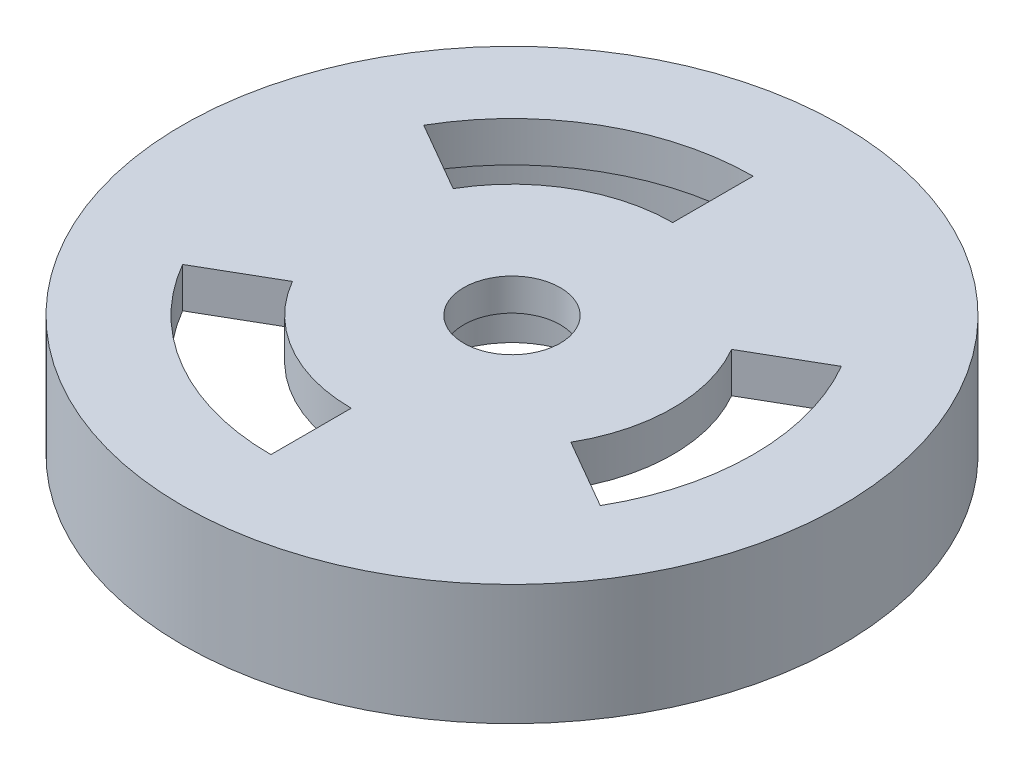
ISO-10303-21;
HEADER;
FILE_DESCRIPTION(('STEP AP214'),'2;1');
FILE_NAME('part.step','',(''),(''),'','','');
FILE_SCHEMA(('AUTOMOTIVE_DESIGN { 1 0 10303 214 1 1 1 1 }'));
ENDSEC;
DATA;
#1=APPLICATION_CONTEXT('core data for automotive mechanical design processes');
#2=APPLICATION_PROTOCOL_DEFINITION('international standard','automotive_design',2000,#1);
#3=PRODUCT_CONTEXT('',#1,'mechanical');
#4=PRODUCT('Part','Part','',(#3));
#5=PRODUCT_RELATED_PRODUCT_CATEGORY('part','',(#4));
#6=PRODUCT_DEFINITION_FORMATION('','',#4);
#7=PRODUCT_DEFINITION_CONTEXT('part definition',#1,'design');
#8=PRODUCT_DEFINITION('design','',#6,#7);
#9=PRODUCT_DEFINITION_SHAPE('','',#8);
#10=(LENGTH_UNIT() NAMED_UNIT(*) SI_UNIT(.MILLI.,.METRE.));
#11=(NAMED_UNIT(*) PLANE_ANGLE_UNIT() SI_UNIT($,.RADIAN.));
#12=(NAMED_UNIT(*) SI_UNIT($,.STERADIAN.) SOLID_ANGLE_UNIT());
#13=UNCERTAINTY_MEASURE_WITH_UNIT(LENGTH_MEASURE(1.E-05),#10,'distance_accuracy_value','');
#14=(GEOMETRIC_REPRESENTATION_CONTEXT(3) GLOBAL_UNCERTAINTY_ASSIGNED_CONTEXT((#13)) GLOBAL_UNIT_ASSIGNED_CONTEXT((#10,
#11,#12)) REPRESENTATION_CONTEXT('',''));
#15=CARTESIAN_POINT('',(0.,0.,0.));
#16=DIRECTION('',(0.,0.,1.));
#17=DIRECTION('',(1.,0.,0.));
#18=AXIS2_PLACEMENT_3D('',#15,#16,#17);
#19=CARTESIAN_POINT('',(0.,10.,0.));
#20=DIRECTION('',(0.,1.,0.));
#21=DIRECTION('',(0.,0.,1.));
#22=AXIS2_PLACEMENT_3D('',#19,#20,#21);
#23=PLANE('',#22);
#24=DIRECTION('',(0.,0.,1.));
#25=VECTOR('',#24,1.);
#26=CARTESIAN_POINT('',(-4.11129463806503E-13,10.,-30.));
#27=LINE('',#26,#25);
#28=CARTESIAN_POINT('',(-4.11129463806503E-13,10.,-30.));
#29=VERTEX_POINT('',#28);
#30=CARTESIAN_POINT('',(-2.66453525910038E-13,10.,-20.));
#31=VERTEX_POINT('',#30);
#32=EDGE_CURVE('E150',#29,#31,#27,.T.);
#33=ORIENTED_EDGE('',*,*,#32,.F.);
#34=CARTESIAN_POINT('',(0.,10.,0.));
#35=DIRECTION('',(0.,-1.,0.));
#36=DIRECTION('',(0.,0.,-1.));
#37=AXIS2_PLACEMENT_3D('',#34,#35,#36);
#38=CIRCLE('',#37,30.);
#39=CARTESIAN_POINT('',(-25.9807621135333,10.,-14.9999999999998));
#40=VERTEX_POINT('',#39);
#41=EDGE_CURVE('E49',#40,#29,#38,.T.);
#42=ORIENTED_EDGE('',*,*,#41,.F.);
#43=DIRECTION('',(-0.866025403784443,0.,-0.499999999999992));
#44=VECTOR('',#43,1.);
#45=CARTESIAN_POINT('',(-17.3205080756889,10.,-9.99999999999984));
#46=LINE('',#45,#44);
#47=CARTESIAN_POINT('',(-17.3205080756889,10.,-9.99999999999984));
#48=VERTEX_POINT('',#47);
#49=EDGE_CURVE('E141',#48,#40,#46,.T.);
#50=ORIENTED_EDGE('',*,*,#49,.F.);
#51=CARTESIAN_POINT('',(0.,10.,0.));
#52=DIRECTION('',(0.,1.,0.));
#53=DIRECTION('',(0.,0.,-1.));
#54=AXIS2_PLACEMENT_3D('',#51,#52,#53);
#55=CIRCLE('',#54,20.);
#56=EDGE_CURVE('E144',#31,#48,#55,.T.);
#57=ORIENTED_EDGE('',*,*,#56,.F.);
#58=EDGE_LOOP('',(#33,#42,#50,#57));
#59=FACE_BOUND('',#58,.T.);
#60=DIRECTION('',(-0.866025403784443,0.,-0.499999999999992));
#61=VECTOR('',#60,1.);
#62=CARTESIAN_POINT('',(25.9807621135333,10.,14.9999999999998));
#63=LINE('',#62,#61);
#64=CARTESIAN_POINT('',(25.9807621135333,10.,14.9999999999998));
#65=VERTEX_POINT('',#64);
#66=CARTESIAN_POINT('',(17.3205080756889,10.,9.99999999999984));
#67=VERTEX_POINT('',#66);
#68=EDGE_CURVE('E175',#65,#67,#63,.T.);
#69=ORIENTED_EDGE('',*,*,#68,.F.);
#70=CARTESIAN_POINT('',(0.,10.,0.));
#71=DIRECTION('',(0.,-1.,0.));
#72=DIRECTION('',(0.,0.,-1.));
#73=AXIS2_PLACEMENT_3D('',#70,#71,#72);
#74=CIRCLE('',#73,30.);
#75=CARTESIAN_POINT('',(25.9807621135331,10.,-15.0000000000001));
#76=VERTEX_POINT('',#75);
#77=EDGE_CURVE('E156',#76,#65,#74,.T.);
#78=ORIENTED_EDGE('',*,*,#77,.F.);
#79=DIRECTION('',(0.866025403784436,0.,-0.500000000000004));
#80=VECTOR('',#79,1.);
#81=CARTESIAN_POINT('',(17.3205080756887,10.,-10.0000000000001));
#82=LINE('',#81,#80);
#83=CARTESIAN_POINT('',(17.3205080756887,10.,-10.0000000000001));
#84=VERTEX_POINT('',#83);
#85=EDGE_CURVE('E164',#84,#76,#82,.T.);
#86=ORIENTED_EDGE('',*,*,#85,.F.);
#87=CARTESIAN_POINT('',(0.,10.,0.));
#88=DIRECTION('',(0.,1.,0.));
#89=DIRECTION('',(0.,0.,-1.));
#90=AXIS2_PLACEMENT_3D('',#87,#88,#89);
#91=CIRCLE('',#90,20.);
#92=EDGE_CURVE('E178',#67,#84,#91,.T.);
#93=ORIENTED_EDGE('',*,*,#92,.F.);
#94=EDGE_LOOP('',(#69,#78,#86,#93));
#95=FACE_BOUND('',#94,.T.);
#96=DIRECTION('',(0.866025403784436,0.,-0.500000000000004));
#97=VECTOR('',#96,1.);
#98=CARTESIAN_POINT('',(-25.9807621135331,10.,15.0000000000001));
#99=LINE('',#98,#97);
#100=CARTESIAN_POINT('',(-25.9807621135331,10.,15.0000000000001));
#101=VERTEX_POINT('',#100);
#102=CARTESIAN_POINT('',(-17.3205080756887,10.,10.0000000000001));
#103=VERTEX_POINT('',#102);
#104=EDGE_CURVE('E207',#101,#103,#99,.T.);
#105=ORIENTED_EDGE('',*,*,#104,.F.);
#106=CARTESIAN_POINT('',(0.,10.,0.));
#107=DIRECTION('',(0.,-1.,0.));
#108=DIRECTION('',(0.,0.,-1.));
#109=AXIS2_PLACEMENT_3D('',#106,#107,#108);
#110=CIRCLE('',#109,30.);
#111=CARTESIAN_POINT('',(0.,10.,30.));
#112=VERTEX_POINT('',#111);
#113=EDGE_CURVE('E185',#112,#101,#110,.T.);
#114=ORIENTED_EDGE('',*,*,#113,.F.);
#115=DIRECTION('',(0.,0.,1.));
#116=VECTOR('',#115,1.);
#117=CARTESIAN_POINT('',(0.,10.,20.));
#118=LINE('',#117,#116);
#119=CARTESIAN_POINT('',(0.,10.,20.));
#120=VERTEX_POINT('',#119);
#121=EDGE_CURVE('E196',#120,#112,#118,.T.);
#122=ORIENTED_EDGE('',*,*,#121,.F.);
#123=CARTESIAN_POINT('',(0.,10.,0.));
#124=DIRECTION('',(0.,1.,0.));
#125=DIRECTION('',(0.,0.,-1.));
#126=AXIS2_PLACEMENT_3D('',#123,#124,#125);
#127=CIRCLE('',#126,20.);
#128=EDGE_CURVE('E210',#103,#120,#127,.T.);
#129=ORIENTED_EDGE('',*,*,#128,.F.);
#130=EDGE_LOOP('',(#105,#114,#122,#129));
#131=FACE_BOUND('',#130,.T.);
#132=CARTESIAN_POINT('',(0.,10.,0.));
#133=DIRECTION('',(0.,1.,0.));
#134=DIRECTION('',(0.,0.,1.));
#135=AXIS2_PLACEMENT_3D('',#132,#133,#134);
#136=CIRCLE('',#135,38.);
#137=CARTESIAN_POINT('',(0.,10.,38.));
#138=VERTEX_POINT('',#137);
#139=EDGE_CURVE('E241',#138,#138,#136,.T.);
#140=ORIENTED_EDGE('',*,*,#139,.F.);
#141=EDGE_LOOP('',(#140));
#142=FACE_BOUND('',#141,.T.);
#143=CARTESIAN_POINT('',(0.,10.,0.));
#144=DIRECTION('',(0.,1.,0.));
#145=DIRECTION('',(0.,0.,1.));
#146=AXIS2_PLACEMENT_3D('',#143,#144,#145);
#147=CIRCLE('',#146,12.5);
#148=CARTESIAN_POINT('',(0.,10.,12.5));
#149=VERTEX_POINT('',#148);
#150=EDGE_CURVE('E11',#149,#149,#147,.F.);
#151=ORIENTED_EDGE('',*,*,#150,.F.);
#152=EDGE_LOOP('',(#151));
#153=FACE_BOUND('',#152,.T.);
#154=ADVANCED_FACE('F34',(#59,#95,#131,#142,#153),#23,.F.);
#155=CARTESIAN_POINT('',(0.,0.,0.));
#156=DIRECTION('',(0.,1.,0.));
#157=DIRECTION('',(0.,0.,1.));
#158=AXIS2_PLACEMENT_3D('',#155,#156,#157);
#159=PLANE('',#158);
#160=CARTESIAN_POINT('',(0.,0.,0.));
#161=DIRECTION('',(0.,1.,0.));
#162=DIRECTION('',(0.,0.,1.));
#163=AXIS2_PLACEMENT_3D('',#160,#161,#162);
#164=CIRCLE('',#163,41.);
#165=CARTESIAN_POINT('',(0.,0.,41.));
#166=VERTEX_POINT('',#165);
#167=EDGE_CURVE('E42',#166,#166,#164,.T.);
#168=ORIENTED_EDGE('',*,*,#167,.F.);
#169=EDGE_LOOP('',(#168));
#170=FACE_BOUND('',#169,.T.);
#171=CARTESIAN_POINT('',(0.,0.,0.));
#172=DIRECTION('',(0.,1.,0.));
#173=DIRECTION('',(0.,0.,1.));
#174=AXIS2_PLACEMENT_3D('',#171,#172,#173);
#175=CIRCLE('',#174,38.);
#176=CARTESIAN_POINT('',(0.,0.,38.));
#177=VERTEX_POINT('',#176);
#178=EDGE_CURVE('E244',#177,#177,#175,.T.);
#179=ORIENTED_EDGE('',*,*,#178,.T.);
#180=EDGE_LOOP('',(#179));
#181=FACE_BOUND('',#180,.T.);
#182=ADVANCED_FACE('F251',(#170,#181),#159,.F.);
#183=CARTESIAN_POINT('',(0.,10.,0.));
#184=DIRECTION('',(0.,-1.,0.));
#185=DIRECTION('',(0.,0.,-1.));
#186=AXIS2_PLACEMENT_3D('',#183,#184,#185);
#187=CYLINDRICAL_SURFACE('',#186,41.);
#188=ORIENTED_EDGE('',*,*,#167,.T.);
#189=EDGE_LOOP('',(#188));
#190=FACE_BOUND('',#189,.T.);
#191=CARTESIAN_POINT('',(0.,15.,0.));
#192=DIRECTION('',(0.,1.,0.));
#193=DIRECTION('',(0.,0.,1.));
#194=AXIS2_PLACEMENT_3D('',#191,#192,#193);
#195=CIRCLE('',#194,41.);
#196=CARTESIAN_POINT('',(0.,15.,41.));
#197=VERTEX_POINT('',#196);
#198=EDGE_CURVE('E238',#197,#197,#195,.T.);
#199=ORIENTED_EDGE('',*,*,#198,.F.);
#200=EDGE_LOOP('',(#199));
#201=FACE_BOUND('',#200,.T.);
#202=ADVANCED_FACE('F36',(#190,#201),#187,.T.);
#203=CARTESIAN_POINT('',(0.,10.,0.));
#204=DIRECTION('',(0.,-1.,0.));
#205=DIRECTION('',(0.,0.,-1.));
#206=AXIS2_PLACEMENT_3D('',#203,#204,#205);
#207=CYLINDRICAL_SURFACE('',#206,38.);
#208=ORIENTED_EDGE('',*,*,#139,.T.);
#209=EDGE_LOOP('',(#208));
#210=FACE_BOUND('',#209,.T.);
#211=ORIENTED_EDGE('',*,*,#178,.F.);
#212=EDGE_LOOP('',(#211));
#213=FACE_BOUND('',#212,.T.);
#214=ADVANCED_FACE('F256',(#210,#213),#207,.F.);
#215=CARTESIAN_POINT('',(0.,15.,0.));
#216=DIRECTION('',(0.,1.,0.));
#217=DIRECTION('',(0.,0.,1.));
#218=AXIS2_PLACEMENT_3D('',#215,#216,#217);
#219=PLANE('',#218);
#220=CARTESIAN_POINT('',(0.,15.,0.));
#221=DIRECTION('',(0.,-1.,0.));
#222=DIRECTION('',(0.,0.,-1.));
#223=AXIS2_PLACEMENT_3D('',#220,#221,#222);
#224=CIRCLE('',#223,30.);
#225=CARTESIAN_POINT('',(-25.9807621135333,15.,-14.9999999999998));
#226=VERTEX_POINT('',#225);
#227=CARTESIAN_POINT('',(-4.11129463806503E-13,15.,-30.));
#228=VERTEX_POINT('',#227);
#229=EDGE_CURVE('E125',#226,#228,#224,.T.);
#230=ORIENTED_EDGE('',*,*,#229,.T.);
#231=DIRECTION('',(0.,0.,1.));
#232=VECTOR('',#231,1.);
#233=CARTESIAN_POINT('',(-4.11129463806503E-13,15.,-30.));
#234=LINE('',#233,#232);
#235=CARTESIAN_POINT('',(-2.67147415300428E-13,15.,-20.));
#236=VERTEX_POINT('',#235);
#237=EDGE_CURVE('E134',#228,#236,#234,.T.);
#238=ORIENTED_EDGE('',*,*,#237,.T.);
#239=CARTESIAN_POINT('',(0.,15.,0.));
#240=DIRECTION('',(0.,1.,0.));
#241=DIRECTION('',(0.,0.,-1.));
#242=AXIS2_PLACEMENT_3D('',#239,#240,#241);
#243=CIRCLE('',#242,20.);
#244=CARTESIAN_POINT('',(-17.3205080756889,15.,-9.99999999999984));
#245=VERTEX_POINT('',#244);
#246=EDGE_CURVE('E57',#236,#245,#243,.T.);
#247=ORIENTED_EDGE('',*,*,#246,.T.);
#248=DIRECTION('',(-0.866025403784443,0.,-0.499999999999992));
#249=VECTOR('',#248,1.);
#250=CARTESIAN_POINT('',(-17.3205080756889,15.,-9.99999999999984));
#251=LINE('',#250,#249);
#252=EDGE_CURVE('E131',#245,#226,#251,.T.);
#253=ORIENTED_EDGE('',*,*,#252,.T.);
#254=EDGE_LOOP('',(#230,#238,#247,#253));
#255=FACE_BOUND('',#254,.T.);
#256=CARTESIAN_POINT('',(0.,15.,0.));
#257=DIRECTION('',(0.,-1.,0.));
#258=DIRECTION('',(0.,0.,-1.));
#259=AXIS2_PLACEMENT_3D('',#256,#257,#258);
#260=CIRCLE('',#259,30.);
#261=CARTESIAN_POINT('',(25.9807621135331,15.,-15.0000000000001));
#262=VERTEX_POINT('',#261);
#263=CARTESIAN_POINT('',(25.9807621135333,15.,14.9999999999998));
#264=VERTEX_POINT('',#263);
#265=EDGE_CURVE('E160',#262,#264,#260,.T.);
#266=ORIENTED_EDGE('',*,*,#265,.T.);
#267=DIRECTION('',(-0.866025403784443,0.,-0.499999999999992));
#268=VECTOR('',#267,1.);
#269=CARTESIAN_POINT('',(25.9807621135333,15.,14.9999999999998));
#270=LINE('',#269,#268);
#271=CARTESIAN_POINT('',(17.3205080756889,15.,9.99999999999984));
#272=VERTEX_POINT('',#271);
#273=EDGE_CURVE('E163',#264,#272,#270,.T.);
#274=ORIENTED_EDGE('',*,*,#273,.T.);
#275=CARTESIAN_POINT('',(0.,15.,0.));
#276=DIRECTION('',(0.,1.,0.));
#277=DIRECTION('',(0.,0.,-1.));
#278=AXIS2_PLACEMENT_3D('',#275,#276,#277);
#279=CIRCLE('',#278,20.);
#280=CARTESIAN_POINT('',(17.3205080756887,15.,-10.0000000000001));
#281=VERTEX_POINT('',#280);
#282=EDGE_CURVE('E167',#272,#281,#279,.T.);
#283=ORIENTED_EDGE('',*,*,#282,.T.);
#284=DIRECTION('',(0.866025403784436,0.,-0.500000000000004));
#285=VECTOR('',#284,1.);
#286=CARTESIAN_POINT('',(17.3205080756887,15.,-10.0000000000001));
#287=LINE('',#286,#285);
#288=EDGE_CURVE('E170',#281,#262,#287,.T.);
#289=ORIENTED_EDGE('',*,*,#288,.T.);
#290=EDGE_LOOP('',(#266,#274,#283,#289));
#291=FACE_BOUND('',#290,.T.);
#292=CARTESIAN_POINT('',(0.,15.,0.));
#293=DIRECTION('',(0.,-1.,0.));
#294=DIRECTION('',(0.,0.,-1.));
#295=AXIS2_PLACEMENT_3D('',#292,#293,#294);
#296=CIRCLE('',#295,30.);
#297=CARTESIAN_POINT('',(0.,15.,30.));
#298=VERTEX_POINT('',#297);
#299=CARTESIAN_POINT('',(-25.9807621135331,15.,15.0000000000001));
#300=VERTEX_POINT('',#299);
#301=EDGE_CURVE('E192',#298,#300,#296,.T.);
#302=ORIENTED_EDGE('',*,*,#301,.T.);
#303=DIRECTION('',(0.866025403784436,0.,-0.500000000000004));
#304=VECTOR('',#303,1.);
#305=CARTESIAN_POINT('',(-25.9807621135331,15.,15.0000000000001));
#306=LINE('',#305,#304);
#307=CARTESIAN_POINT('',(-17.3205080756887,15.,10.0000000000001));
#308=VERTEX_POINT('',#307);
#309=EDGE_CURVE('E195',#300,#308,#306,.T.);
#310=ORIENTED_EDGE('',*,*,#309,.T.);
#311=CARTESIAN_POINT('',(0.,15.,0.));
#312=DIRECTION('',(0.,1.,0.));
#313=DIRECTION('',(0.,0.,-1.));
#314=AXIS2_PLACEMENT_3D('',#311,#312,#313);
#315=CIRCLE('',#314,20.);
#316=CARTESIAN_POINT('',(0.,15.,20.));
#317=VERTEX_POINT('',#316);
#318=EDGE_CURVE('E199',#308,#317,#315,.T.);
#319=ORIENTED_EDGE('',*,*,#318,.T.);
#320=DIRECTION('',(0.,0.,1.));
#321=VECTOR('',#320,1.);
#322=CARTESIAN_POINT('',(0.,15.,20.));
#323=LINE('',#322,#321);
#324=EDGE_CURVE('E202',#317,#298,#323,.T.);
#325=ORIENTED_EDGE('',*,*,#324,.T.);
#326=EDGE_LOOP('',(#302,#310,#319,#325));
#327=FACE_BOUND('',#326,.T.);
#328=CARTESIAN_POINT('',(0.,15.,0.));
#329=DIRECTION('',(0.,-1.,0.));
#330=DIRECTION('',(0.,0.,-1.));
#331=AXIS2_PLACEMENT_3D('',#328,#329,#330);
#332=CIRCLE('',#331,6.);
#333=CARTESIAN_POINT('',(0.,15.,-6.));
#334=VERTEX_POINT('',#333);
#335=EDGE_CURVE('E224',#334,#334,#332,.T.);
#336=ORIENTED_EDGE('',*,*,#335,.T.);
#337=EDGE_LOOP('',(#336));
#338=FACE_BOUND('',#337,.T.);
#339=ORIENTED_EDGE('',*,*,#198,.T.);
#340=EDGE_LOOP('',(#339));
#341=FACE_BOUND('',#340,.T.);
#342=ADVANCED_FACE('F138',(#255,#291,#327,#338,#341),#219,.T.);
#343=CARTESIAN_POINT('',(0.,5.,0.));
#344=DIRECTION('',(0.,1.,0.));
#345=DIRECTION('',(0.,0.,1.));
#346=AXIS2_PLACEMENT_3D('',#343,#344,#345);
#347=CYLINDRICAL_SURFACE('',#346,12.5);
#348=CARTESIAN_POINT('',(0.,5.,0.));
#349=DIRECTION('',(0.,-1.,0.));
#350=DIRECTION('',(0.,0.,-1.));
#351=AXIS2_PLACEMENT_3D('',#348,#349,#350);
#352=CIRCLE('',#351,12.5);
#353=CARTESIAN_POINT('',(0.,5.,-12.5));
#354=VERTEX_POINT('',#353);
#355=EDGE_CURVE('E233',#354,#354,#352,.T.);
#356=ORIENTED_EDGE('',*,*,#355,.F.);
#357=EDGE_LOOP('',(#356));
#358=FACE_BOUND('',#357,.T.);
#359=ORIENTED_EDGE('',*,*,#150,.T.);
#360=EDGE_LOOP('',(#359));
#361=FACE_BOUND('',#360,.T.);
#362=ADVANCED_FACE('F264',(#358,#361),#347,.T.);
#363=CARTESIAN_POINT('',(0.,5.,0.));
#364=DIRECTION('',(0.,-1.,0.));
#365=DIRECTION('',(0.,0.,-1.));
#366=AXIS2_PLACEMENT_3D('',#363,#364,#365);
#367=PLANE('',#366);
#368=CARTESIAN_POINT('',(0.,5.,0.));
#369=DIRECTION('',(0.,-1.,0.));
#370=DIRECTION('',(0.,0.,-1.));
#371=AXIS2_PLACEMENT_3D('',#368,#369,#370);
#372=CIRCLE('',#371,10.);
#373=CARTESIAN_POINT('',(0.,5.,-10.));
#374=VERTEX_POINT('',#373);
#375=EDGE_CURVE('E227',#374,#374,#372,.T.);
#376=ORIENTED_EDGE('',*,*,#375,.F.);
#377=EDGE_LOOP('',(#376));
#378=FACE_BOUND('',#377,.T.);
#379=ORIENTED_EDGE('',*,*,#355,.T.);
#380=EDGE_LOOP('',(#379));
#381=FACE_BOUND('',#380,.T.);
#382=ADVANCED_FACE('F275',(#378,#381),#367,.T.);
#383=CARTESIAN_POINT('',(0.,11.,0.));
#384=DIRECTION('',(0.,-1.,0.));
#385=DIRECTION('',(0.,0.,-1.));
#386=AXIS2_PLACEMENT_3D('',#383,#384,#385);
#387=CYLINDRICAL_SURFACE('',#386,10.);
#388=CARTESIAN_POINT('',(0.,11.,0.));
#389=DIRECTION('',(0.,-1.,0.));
#390=DIRECTION('',(0.,0.,-1.));
#391=AXIS2_PLACEMENT_3D('',#388,#389,#390);
#392=CIRCLE('',#391,10.);
#393=CARTESIAN_POINT('',(0.,11.,-10.));
#394=VERTEX_POINT('',#393);
#395=EDGE_CURVE('E230',#394,#394,#392,.T.);
#396=ORIENTED_EDGE('',*,*,#395,.F.);
#397=EDGE_LOOP('',(#396));
#398=FACE_BOUND('',#397,.T.);
#399=ORIENTED_EDGE('',*,*,#375,.T.);
#400=EDGE_LOOP('',(#399));
#401=FACE_BOUND('',#400,.T.);
#402=ADVANCED_FACE('F279',(#398,#401),#387,.F.);
#403=CARTESIAN_POINT('',(0.,11.,0.));
#404=DIRECTION('',(0.,-1.,0.));
#405=DIRECTION('',(0.,0.,-1.));
#406=AXIS2_PLACEMENT_3D('',#403,#404,#405);
#407=PLANE('',#406);
#408=CARTESIAN_POINT('',(0.,11.,0.));
#409=DIRECTION('',(0.,-1.,0.));
#410=DIRECTION('',(0.,0.,-1.));
#411=AXIS2_PLACEMENT_3D('',#408,#409,#410);
#412=CIRCLE('',#411,6.);
#413=CARTESIAN_POINT('',(0.,11.,-6.));
#414=VERTEX_POINT('',#413);
#415=EDGE_CURVE('E217',#414,#414,#412,.T.);
#416=ORIENTED_EDGE('',*,*,#415,.F.);
#417=EDGE_LOOP('',(#416));
#418=FACE_BOUND('',#417,.T.);
#419=ORIENTED_EDGE('',*,*,#395,.T.);
#420=EDGE_LOOP('',(#419));
#421=FACE_BOUND('',#420,.T.);
#422=ADVANCED_FACE('F283',(#418,#421),#407,.T.);
#423=CARTESIAN_POINT('',(0.,15.,0.));
#424=DIRECTION('',(0.,-1.,0.));
#425=DIRECTION('',(0.,0.,-1.));
#426=AXIS2_PLACEMENT_3D('',#423,#424,#425);
#427=CYLINDRICAL_SURFACE('',#426,6.);
#428=ORIENTED_EDGE('',*,*,#335,.F.);
#429=EDGE_LOOP('',(#428));
#430=FACE_BOUND('',#429,.T.);
#431=ORIENTED_EDGE('',*,*,#415,.T.);
#432=EDGE_LOOP('',(#431));
#433=FACE_BOUND('',#432,.T.);
#434=ADVANCED_FACE('F287',(#430,#433),#427,.F.);
#435=CARTESIAN_POINT('',(0.,15.,0.));
#436=DIRECTION('',(0.,-1.,0.));
#437=DIRECTION('',(0.,0.,-1.));
#438=AXIS2_PLACEMENT_3D('',#435,#436,#437);
#439=CYLINDRICAL_SURFACE('',#438,30.);
#440=ORIENTED_EDGE('',*,*,#113,.T.);
#441=DIRECTION('',(0.,-1.,0.));
#442=VECTOR('',#441,1.);
#443=CARTESIAN_POINT('',(-25.9807621135331,15.,15.0000000000001));
#444=LINE('',#443,#442);
#445=EDGE_CURVE('E205',#300,#101,#444,.T.);
#446=ORIENTED_EDGE('',*,*,#445,.F.);
#447=ORIENTED_EDGE('',*,*,#301,.F.);
#448=DIRECTION('',(0.,-1.,0.));
#449=VECTOR('',#448,1.);
#450=CARTESIAN_POINT('',(0.,15.,30.));
#451=LINE('',#450,#449);
#452=EDGE_CURVE('E215',#298,#112,#451,.T.);
#453=ORIENTED_EDGE('',*,*,#452,.T.);
#454=EDGE_LOOP('',(#440,#446,#447,#453));
#455=FACE_BOUND('',#454,.T.);
#456=ADVANCED_FACE('F291',(#455),#439,.F.);
#457=CARTESIAN_POINT('',(0.,15.,20.));
#458=DIRECTION('',(1.,0.,0.));
#459=DIRECTION('',(0.,0.,-1.));
#460=AXIS2_PLACEMENT_3D('',#457,#458,#459);
#461=PLANE('',#460);
#462=ORIENTED_EDGE('',*,*,#121,.T.);
#463=ORIENTED_EDGE('',*,*,#452,.F.);
#464=ORIENTED_EDGE('',*,*,#324,.F.);
#465=DIRECTION('',(0.,-1.,0.));
#466=VECTOR('',#465,1.);
#467=CARTESIAN_POINT('',(0.,15.,20.));
#468=LINE('',#467,#466);
#469=EDGE_CURVE('E218',#317,#120,#468,.T.);
#470=ORIENTED_EDGE('',*,*,#469,.T.);
#471=EDGE_LOOP('',(#462,#463,#464,#470));
#472=FACE_BOUND('',#471,.T.);
#473=ADVANCED_FACE('F295',(#472),#461,.F.);
#474=CARTESIAN_POINT('',(0.,15.,0.));
#475=DIRECTION('',(0.,-1.,0.));
#476=DIRECTION('',(0.,0.,-1.));
#477=AXIS2_PLACEMENT_3D('',#474,#475,#476);
#478=CYLINDRICAL_SURFACE('',#477,20.);
#479=ORIENTED_EDGE('',*,*,#128,.T.);
#480=ORIENTED_EDGE('',*,*,#469,.F.);
#481=ORIENTED_EDGE('',*,*,#318,.F.);
#482=DIRECTION('',(0.,-1.,0.));
#483=VECTOR('',#482,1.);
#484=CARTESIAN_POINT('',(-17.3205080756887,15.,10.0000000000001));
#485=LINE('',#484,#483);
#486=EDGE_CURVE('E220',#308,#103,#485,.T.);
#487=ORIENTED_EDGE('',*,*,#486,.T.);
#488=EDGE_LOOP('',(#479,#480,#481,#487));
#489=FACE_BOUND('',#488,.T.);
#490=ADVANCED_FACE('F301',(#489),#478,.T.);
#491=CARTESIAN_POINT('',(-25.9807621135331,15.,15.0000000000001));
#492=DIRECTION('',(-0.500000000000004,0.,-0.866025403784436));
#493=DIRECTION('',(-0.866025403784436,0.,0.500000000000004));
#494=AXIS2_PLACEMENT_3D('',#491,#492,#493);
#495=PLANE('',#494);
#496=ORIENTED_EDGE('',*,*,#104,.T.);
#497=ORIENTED_EDGE('',*,*,#486,.F.);
#498=ORIENTED_EDGE('',*,*,#309,.F.);
#499=ORIENTED_EDGE('',*,*,#445,.T.);
#500=EDGE_LOOP('',(#496,#497,#498,#499));
#501=FACE_BOUND('',#500,.T.);
#502=ADVANCED_FACE('F297',(#501),#495,.F.);
#503=CARTESIAN_POINT('',(0.,15.,0.));
#504=DIRECTION('',(0.,-1.,0.));
#505=DIRECTION('',(0.,0.,-1.));
#506=AXIS2_PLACEMENT_3D('',#503,#504,#505);
#507=CYLINDRICAL_SURFACE('',#506,30.);
#508=ORIENTED_EDGE('',*,*,#77,.T.);
#509=DIRECTION('',(0.,-1.,0.));
#510=VECTOR('',#509,1.);
#511=CARTESIAN_POINT('',(25.9807621135333,15.,14.9999999999998));
#512=LINE('',#511,#510);
#513=EDGE_CURVE('E173',#264,#65,#512,.T.);
#514=ORIENTED_EDGE('',*,*,#513,.F.);
#515=ORIENTED_EDGE('',*,*,#265,.F.);
#516=DIRECTION('',(0.,-1.,0.));
#517=VECTOR('',#516,1.);
#518=CARTESIAN_POINT('',(25.9807621135331,15.,-15.0000000000001));
#519=LINE('',#518,#517);
#520=EDGE_CURVE('E183',#262,#76,#519,.T.);
#521=ORIENTED_EDGE('',*,*,#520,.T.);
#522=EDGE_LOOP('',(#508,#514,#515,#521));
#523=FACE_BOUND('',#522,.T.);
#524=ADVANCED_FACE('F300',(#523),#507,.F.);
#525=CARTESIAN_POINT('',(17.3205080756887,15.,-10.0000000000001));
#526=DIRECTION('',(-0.500000000000004,0.,-0.866025403784436));
#527=DIRECTION('',(-0.866025403784436,0.,0.500000000000004));
#528=AXIS2_PLACEMENT_3D('',#525,#526,#527);
#529=PLANE('',#528);
#530=ORIENTED_EDGE('',*,*,#85,.T.);
#531=ORIENTED_EDGE('',*,*,#520,.F.);
#532=ORIENTED_EDGE('',*,*,#288,.F.);
#533=DIRECTION('',(0.,-1.,0.));
#534=VECTOR('',#533,1.);
#535=CARTESIAN_POINT('',(17.3205080756887,15.,-10.0000000000001));
#536=LINE('',#535,#534);
#537=EDGE_CURVE('E186',#281,#84,#536,.T.);
#538=ORIENTED_EDGE('',*,*,#537,.T.);
#539=EDGE_LOOP('',(#530,#531,#532,#538));
#540=FACE_BOUND('',#539,.T.);
#541=ADVANCED_FACE('F311',(#540),#529,.F.);
#542=CARTESIAN_POINT('',(0.,15.,0.));
#543=DIRECTION('',(0.,-1.,0.));
#544=DIRECTION('',(0.,0.,-1.));
#545=AXIS2_PLACEMENT_3D('',#542,#543,#544);
#546=CYLINDRICAL_SURFACE('',#545,20.);
#547=ORIENTED_EDGE('',*,*,#92,.T.);
#548=ORIENTED_EDGE('',*,*,#537,.F.);
#549=ORIENTED_EDGE('',*,*,#282,.F.);
#550=DIRECTION('',(0.,-1.,0.));
#551=VECTOR('',#550,1.);
#552=CARTESIAN_POINT('',(17.3205080756889,15.,9.99999999999984));
#553=LINE('',#552,#551);
#554=EDGE_CURVE('E188',#272,#67,#553,.T.);
#555=ORIENTED_EDGE('',*,*,#554,.T.);
#556=EDGE_LOOP('',(#547,#548,#549,#555));
#557=FACE_BOUND('',#556,.T.);
#558=ADVANCED_FACE('F316',(#557),#546,.T.);
#559=CARTESIAN_POINT('',(25.9807621135333,15.,14.9999999999998));
#560=DIRECTION('',(-0.499999999999992,0.,0.866025403784443));
#561=DIRECTION('',(0.866025403784444,0.,0.499999999999992));
#562=AXIS2_PLACEMENT_3D('',#559,#560,#561);
#563=PLANE('',#562);
#564=ORIENTED_EDGE('',*,*,#68,.T.);
#565=ORIENTED_EDGE('',*,*,#554,.F.);
#566=ORIENTED_EDGE('',*,*,#273,.F.);
#567=ORIENTED_EDGE('',*,*,#513,.T.);
#568=EDGE_LOOP('',(#564,#565,#566,#567));
#569=FACE_BOUND('',#568,.T.);
#570=ADVANCED_FACE('F313',(#569),#563,.F.);
#571=CARTESIAN_POINT('',(0.,15.,0.));
#572=DIRECTION('',(0.,-1.,0.));
#573=DIRECTION('',(0.,0.,-1.));
#574=AXIS2_PLACEMENT_3D('',#571,#572,#573);
#575=CYLINDRICAL_SURFACE('',#574,30.);
#576=ORIENTED_EDGE('',*,*,#41,.T.);
#577=DIRECTION('',(0.,-1.,0.));
#578=VECTOR('',#577,1.);
#579=CARTESIAN_POINT('',(-4.11129463806503E-13,15.,-30.));
#580=LINE('',#579,#578);
#581=EDGE_CURVE('E121',#228,#29,#580,.T.);
#582=ORIENTED_EDGE('',*,*,#581,.F.);
#583=ORIENTED_EDGE('',*,*,#229,.F.);
#584=DIRECTION('',(0.,-1.,0.));
#585=VECTOR('',#584,1.);
#586=CARTESIAN_POINT('',(-25.9807621135333,15.,-14.9999999999998));
#587=LINE('',#586,#585);
#588=EDGE_CURVE('E154',#226,#40,#587,.T.);
#589=ORIENTED_EDGE('',*,*,#588,.T.);
#590=EDGE_LOOP('',(#576,#582,#583,#589));
#591=FACE_BOUND('',#590,.T.);
#592=ADVANCED_FACE('F123',(#591),#575,.F.);
#593=CARTESIAN_POINT('',(-17.3205080756889,15.,-9.99999999999984));
#594=DIRECTION('',(-0.499999999999992,0.,0.866025403784443));
#595=DIRECTION('',(0.866025403784443,0.,0.499999999999992));
#596=AXIS2_PLACEMENT_3D('',#593,#594,#595);
#597=PLANE('',#596);
#598=ORIENTED_EDGE('',*,*,#49,.T.);
#599=ORIENTED_EDGE('',*,*,#588,.F.);
#600=ORIENTED_EDGE('',*,*,#252,.F.);
#601=DIRECTION('',(0.,-1.,0.));
#602=VECTOR('',#601,1.);
#603=CARTESIAN_POINT('',(-17.3205080756889,15.,-9.99999999999984));
#604=LINE('',#603,#602);
#605=EDGE_CURVE('E157',#245,#48,#604,.T.);
#606=ORIENTED_EDGE('',*,*,#605,.T.);
#607=EDGE_LOOP('',(#598,#599,#600,#606));
#608=FACE_BOUND('',#607,.T.);
#609=ADVANCED_FACE('F326',(#608),#597,.F.);
#610=CARTESIAN_POINT('',(0.,15.,0.));
#611=DIRECTION('',(0.,-1.,0.));
#612=DIRECTION('',(0.,0.,-1.));
#613=AXIS2_PLACEMENT_3D('',#610,#611,#612);
#614=CYLINDRICAL_SURFACE('',#613,20.);
#615=ORIENTED_EDGE('',*,*,#56,.T.);
#616=ORIENTED_EDGE('',*,*,#605,.F.);
#617=ORIENTED_EDGE('',*,*,#246,.F.);
#618=DIRECTION('',(0.,-1.,0.));
#619=VECTOR('',#618,1.);
#620=CARTESIAN_POINT('',(-2.66453525910038E-13,15.,-20.));
#621=LINE('',#620,#619);
#622=EDGE_CURVE('E130',#236,#31,#621,.T.);
#623=ORIENTED_EDGE('',*,*,#622,.T.);
#624=EDGE_LOOP('',(#615,#616,#617,#623));
#625=FACE_BOUND('',#624,.T.);
#626=ADVANCED_FACE('F329',(#625),#614,.T.);
#627=CARTESIAN_POINT('',(-4.11129463806503E-13,15.,-30.));
#628=DIRECTION('',(1.,0.,0.));
#629=DIRECTION('',(0.,0.,-1.));
#630=AXIS2_PLACEMENT_3D('',#627,#628,#629);
#631=PLANE('',#630);
#632=ORIENTED_EDGE('',*,*,#32,.T.);
#633=ORIENTED_EDGE('',*,*,#622,.F.);
#634=ORIENTED_EDGE('',*,*,#237,.F.);
#635=ORIENTED_EDGE('',*,*,#581,.T.);
#636=EDGE_LOOP('',(#632,#633,#634,#635));
#637=FACE_BOUND('',#636,.T.);
#638=ADVANCED_FACE('F135',(#637),#631,.F.);
#639=CLOSED_SHELL('',(#154,#182,#202,#214,#342,#362,#382,#402,#422,#434,#456,#473,#490,#502,
#524,#541,#558,#570,#592,#609,#626,#638));
#640=MANIFOLD_SOLID_BREP('B2',#639);
#641=ADVANCED_BREP_SHAPE_REPRESENTATION('',(#18,#640),#14);
#642=SHAPE_DEFINITION_REPRESENTATION(#9,#641);
ENDSEC;
END-ISO-10303-21;
